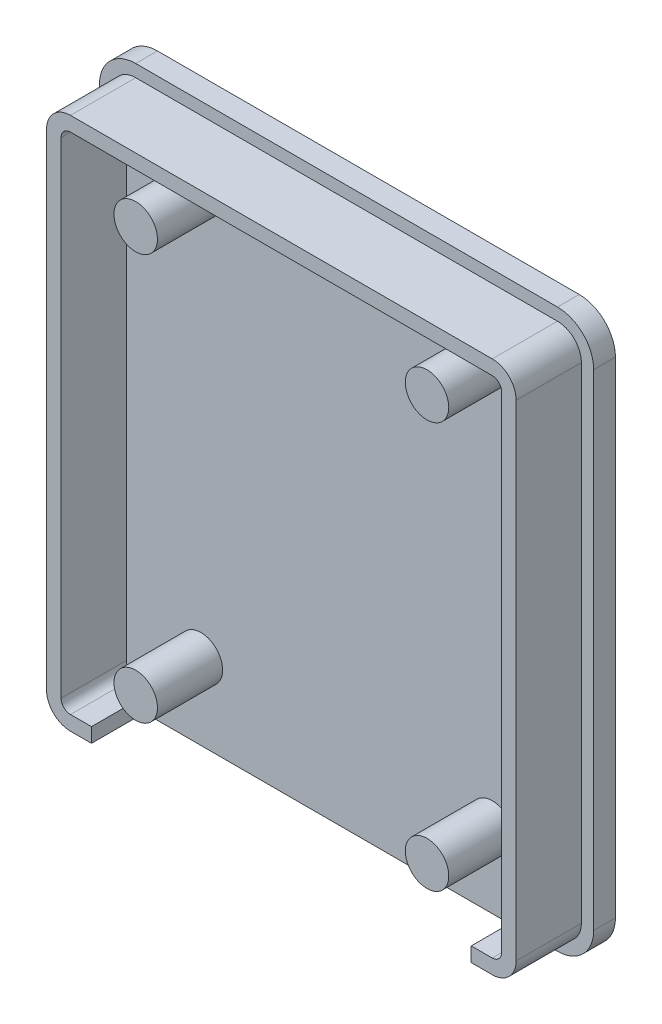
ISO-10303-21;
HEADER;
FILE_DESCRIPTION(('STEP AP214'),'2;1');
FILE_NAME('part.step','',(''),(''),'','','');
FILE_SCHEMA(('AUTOMOTIVE_DESIGN { 1 0 10303 214 1 1 1 1 }'));
ENDSEC;
DATA;
#1=APPLICATION_CONTEXT('core data for automotive mechanical design processes');
#2=APPLICATION_PROTOCOL_DEFINITION('international standard','automotive_design',2000,#1);
#3=PRODUCT_CONTEXT('',#1,'mechanical');
#4=PRODUCT('Part','Part','',(#3));
#5=PRODUCT_RELATED_PRODUCT_CATEGORY('part','',(#4));
#6=PRODUCT_DEFINITION_FORMATION('','',#4);
#7=PRODUCT_DEFINITION_CONTEXT('part definition',#1,'design');
#8=PRODUCT_DEFINITION('design','',#6,#7);
#9=PRODUCT_DEFINITION_SHAPE('','',#8);
#10=(LENGTH_UNIT() NAMED_UNIT(*) SI_UNIT(.MILLI.,.METRE.));
#11=(NAMED_UNIT(*) PLANE_ANGLE_UNIT() SI_UNIT($,.RADIAN.));
#12=(NAMED_UNIT(*) SI_UNIT($,.STERADIAN.) SOLID_ANGLE_UNIT());
#13=UNCERTAINTY_MEASURE_WITH_UNIT(LENGTH_MEASURE(1.E-05),#10,'distance_accuracy_value','');
#14=(GEOMETRIC_REPRESENTATION_CONTEXT(3) GLOBAL_UNCERTAINTY_ASSIGNED_CONTEXT((#13)) GLOBAL_UNIT_ASSIGNED_CONTEXT((#10,
#11,#12)) REPRESENTATION_CONTEXT('',''));
#15=CARTESIAN_POINT('',(0.,0.,0.));
#16=DIRECTION('',(0.,0.,1.));
#17=DIRECTION('',(1.,0.,0.));
#18=AXIS2_PLACEMENT_3D('',#15,#16,#17);
#19=CARTESIAN_POINT('',(-14.55,16.75,1.5));
#20=DIRECTION('',(0.,0.,-1.));
#21=DIRECTION('',(-1.,0.,0.));
#22=AXIS2_PLACEMENT_3D('',#19,#20,#21);
#23=CYLINDRICAL_SURFACE('',#22,2.5);
#24=CARTESIAN_POINT('',(-14.55,16.75,0.));
#25=DIRECTION('',(0.,0.,1.));
#26=DIRECTION('',(1.,0.,0.));
#27=AXIS2_PLACEMENT_3D('',#24,#25,#26);
#28=CIRCLE('',#27,2.5);
#29=CARTESIAN_POINT('',(-17.05,16.75,0.));
#30=VERTEX_POINT('',#29);
#31=CARTESIAN_POINT('',(-14.55,19.25,0.));
#32=VERTEX_POINT('',#31);
#33=EDGE_CURVE('E641',#30,#32,#28,.F.);
#34=ORIENTED_EDGE('',*,*,#33,.F.);
#35=DIRECTION('',(0.,0.,-1.));
#36=VECTOR('',#35,1.);
#37=CARTESIAN_POINT('',(-17.05,16.75,1.5));
#38=LINE('',#37,#36);
#39=CARTESIAN_POINT('',(-17.05,16.75,1.5));
#40=VERTEX_POINT('',#39);
#41=EDGE_CURVE('E293',#40,#30,#38,.T.);
#42=ORIENTED_EDGE('',*,*,#41,.F.);
#43=CARTESIAN_POINT('',(-14.55,16.75,1.5));
#44=DIRECTION('',(0.,0.,1.));
#45=DIRECTION('',(1.,0.,0.));
#46=AXIS2_PLACEMENT_3D('',#43,#44,#45);
#47=CIRCLE('',#46,2.5);
#48=CARTESIAN_POINT('',(-14.55,19.25,1.5));
#49=VERTEX_POINT('',#48);
#50=EDGE_CURVE('E642',#40,#49,#47,.F.);
#51=ORIENTED_EDGE('',*,*,#50,.T.);
#52=DIRECTION('',(0.,0.,-1.));
#53=VECTOR('',#52,1.);
#54=CARTESIAN_POINT('',(-14.55,19.25,1.5));
#55=LINE('',#54,#53);
#56=EDGE_CURVE('E664',#49,#32,#55,.T.);
#57=ORIENTED_EDGE('',*,*,#56,.T.);
#58=EDGE_LOOP('',(#34,#42,#51,#57));
#59=FACE_BOUND('',#58,.T.);
#60=ADVANCED_FACE('F290',(#59),#23,.T.);
#61=CARTESIAN_POINT('',(-17.05,0.,1.5));
#62=DIRECTION('',(-1.,0.,0.));
#63=DIRECTION('',(0.,0.,1.));
#64=AXIS2_PLACEMENT_3D('',#61,#62,#63);
#65=PLANE('',#64);
#66=DIRECTION('',(0.,1.,0.));
#67=VECTOR('',#66,1.);
#68=CARTESIAN_POINT('',(-17.05,0.,0.));
#69=LINE('',#68,#67);
#70=CARTESIAN_POINT('',(-17.05,-16.75,0.));
#71=VERTEX_POINT('',#70);
#72=EDGE_CURVE('E667',#71,#30,#69,.T.);
#73=ORIENTED_EDGE('',*,*,#72,.F.);
#74=DIRECTION('',(0.,0.,-1.));
#75=VECTOR('',#74,1.);
#76=CARTESIAN_POINT('',(-17.05,-16.75,1.5));
#77=LINE('',#76,#75);
#78=CARTESIAN_POINT('',(-17.05,-16.75,1.5));
#79=VERTEX_POINT('',#78);
#80=EDGE_CURVE('E697',#79,#71,#77,.T.);
#81=ORIENTED_EDGE('',*,*,#80,.F.);
#82=DIRECTION('',(0.,1.,0.));
#83=VECTOR('',#82,1.);
#84=CARTESIAN_POINT('',(-17.05,0.,1.5));
#85=LINE('',#84,#83);
#86=EDGE_CURVE('E645',#79,#40,#85,.T.);
#87=ORIENTED_EDGE('',*,*,#86,.T.);
#88=ORIENTED_EDGE('',*,*,#41,.T.);
#89=EDGE_LOOP('',(#73,#81,#87,#88));
#90=FACE_BOUND('',#89,.T.);
#91=ADVANCED_FACE('F741',(#90),#65,.T.);
#92=CARTESIAN_POINT('',(-14.55,-16.75,1.5));
#93=DIRECTION('',(0.,0.,-1.));
#94=DIRECTION('',(-1.,0.,0.));
#95=AXIS2_PLACEMENT_3D('',#92,#93,#94);
#96=CYLINDRICAL_SURFACE('',#95,2.5);
#97=CARTESIAN_POINT('',(-14.55,-16.75,0.));
#98=DIRECTION('',(0.,0.,1.));
#99=DIRECTION('',(1.,0.,0.));
#100=AXIS2_PLACEMENT_3D('',#97,#98,#99);
#101=CIRCLE('',#100,2.5);
#102=CARTESIAN_POINT('',(-14.55,-19.25,0.));
#103=VERTEX_POINT('',#102);
#104=EDGE_CURVE('E670',#103,#71,#101,.F.);
#105=ORIENTED_EDGE('',*,*,#104,.F.);
#106=DIRECTION('',(0.,0.,-1.));
#107=VECTOR('',#106,1.);
#108=CARTESIAN_POINT('',(-14.55,-19.25,1.5));
#109=LINE('',#108,#107);
#110=CARTESIAN_POINT('',(-14.55,-19.25,1.5));
#111=VERTEX_POINT('',#110);
#112=EDGE_CURVE('E696',#111,#103,#109,.T.);
#113=ORIENTED_EDGE('',*,*,#112,.F.);
#114=CARTESIAN_POINT('',(-14.55,-16.75,1.5));
#115=DIRECTION('',(0.,0.,1.));
#116=DIRECTION('',(1.,0.,0.));
#117=AXIS2_PLACEMENT_3D('',#114,#115,#116);
#118=CIRCLE('',#117,2.5);
#119=EDGE_CURVE('E649',#111,#79,#118,.F.);
#120=ORIENTED_EDGE('',*,*,#119,.T.);
#121=ORIENTED_EDGE('',*,*,#80,.T.);
#122=EDGE_LOOP('',(#105,#113,#120,#121));
#123=FACE_BOUND('',#122,.T.);
#124=ADVANCED_FACE('F746',(#123),#96,.T.);
#125=CARTESIAN_POINT('',(0.,-19.25,1.5));
#126=DIRECTION('',(0.,1.,0.));
#127=DIRECTION('',(0.,0.,1.));
#128=AXIS2_PLACEMENT_3D('',#125,#126,#127);
#129=PLANE('',#128);
#130=DIRECTION('',(1.,0.,0.));
#131=VECTOR('',#130,1.);
#132=CARTESIAN_POINT('',(0.,-19.25,0.));
#133=LINE('',#132,#131);
#134=CARTESIAN_POINT('',(14.55,-19.25,0.));
#135=VERTEX_POINT('',#134);
#136=EDGE_CURVE('E673',#103,#135,#133,.T.);
#137=ORIENTED_EDGE('',*,*,#136,.T.);
#138=DIRECTION('',(0.,0.,-1.));
#139=VECTOR('',#138,1.);
#140=CARTESIAN_POINT('',(14.55,-19.25,1.5));
#141=LINE('',#140,#139);
#142=CARTESIAN_POINT('',(14.55,-19.25,1.5));
#143=VERTEX_POINT('',#142);
#144=EDGE_CURVE('E693',#143,#135,#141,.T.);
#145=ORIENTED_EDGE('',*,*,#144,.F.);
#146=DIRECTION('',(1.,0.,0.));
#147=VECTOR('',#146,1.);
#148=CARTESIAN_POINT('',(0.,-19.25,1.5));
#149=LINE('',#148,#147);
#150=EDGE_CURVE('E652',#111,#143,#149,.T.);
#151=ORIENTED_EDGE('',*,*,#150,.F.);
#152=ORIENTED_EDGE('',*,*,#112,.T.);
#153=EDGE_LOOP('',(#137,#145,#151,#152));
#154=FACE_BOUND('',#153,.T.);
#155=ADVANCED_FACE('F760',(#154),#129,.F.);
#156=CARTESIAN_POINT('',(14.55,-16.75,1.5));
#157=DIRECTION('',(0.,0.,-1.));
#158=DIRECTION('',(-1.,0.,0.));
#159=AXIS2_PLACEMENT_3D('',#156,#157,#158);
#160=CYLINDRICAL_SURFACE('',#159,2.5);
#161=CARTESIAN_POINT('',(14.55,-16.75,0.));
#162=DIRECTION('',(0.,0.,1.));
#163=DIRECTION('',(1.,0.,0.));
#164=AXIS2_PLACEMENT_3D('',#161,#162,#163);
#165=CIRCLE('',#164,2.5);
#166=CARTESIAN_POINT('',(17.05,-16.75,0.));
#167=VERTEX_POINT('',#166);
#168=EDGE_CURVE('E675',#135,#167,#165,.T.);
#169=ORIENTED_EDGE('',*,*,#168,.T.);
#170=DIRECTION('',(0.,0.,-1.));
#171=VECTOR('',#170,1.);
#172=CARTESIAN_POINT('',(17.05,-16.75,1.5));
#173=LINE('',#172,#171);
#174=CARTESIAN_POINT('',(17.05,-16.75,1.5));
#175=VERTEX_POINT('',#174);
#176=EDGE_CURVE('E690',#175,#167,#173,.T.);
#177=ORIENTED_EDGE('',*,*,#176,.F.);
#178=CARTESIAN_POINT('',(14.55,-16.75,1.5));
#179=DIRECTION('',(0.,0.,1.));
#180=DIRECTION('',(1.,0.,0.));
#181=AXIS2_PLACEMENT_3D('',#178,#179,#180);
#182=CIRCLE('',#181,2.5);
#183=EDGE_CURVE('E654',#143,#175,#182,.T.);
#184=ORIENTED_EDGE('',*,*,#183,.F.);
#185=ORIENTED_EDGE('',*,*,#144,.T.);
#186=EDGE_LOOP('',(#169,#177,#184,#185));
#187=FACE_BOUND('',#186,.T.);
#188=ADVANCED_FACE('F767',(#187),#160,.T.);
#189=CARTESIAN_POINT('',(17.05,0.,1.5));
#190=DIRECTION('',(-1.,0.,0.));
#191=DIRECTION('',(0.,0.,1.));
#192=AXIS2_PLACEMENT_3D('',#189,#190,#191);
#193=PLANE('',#192);
#194=DIRECTION('',(0.,1.,0.));
#195=VECTOR('',#194,1.);
#196=CARTESIAN_POINT('',(17.05,0.,0.));
#197=LINE('',#196,#195);
#198=CARTESIAN_POINT('',(17.05,16.75,0.));
#199=VERTEX_POINT('',#198);
#200=EDGE_CURVE('E677',#167,#199,#197,.T.);
#201=ORIENTED_EDGE('',*,*,#200,.T.);
#202=DIRECTION('',(0.,0.,-1.));
#203=VECTOR('',#202,1.);
#204=CARTESIAN_POINT('',(17.05,16.75,1.5));
#205=LINE('',#204,#203);
#206=CARTESIAN_POINT('',(17.05,16.75,1.5));
#207=VERTEX_POINT('',#206);
#208=EDGE_CURVE('E688',#207,#199,#205,.T.);
#209=ORIENTED_EDGE('',*,*,#208,.F.);
#210=DIRECTION('',(0.,1.,0.));
#211=VECTOR('',#210,1.);
#212=CARTESIAN_POINT('',(17.05,0.,1.5));
#213=LINE('',#212,#211);
#214=EDGE_CURVE('E656',#175,#207,#213,.T.);
#215=ORIENTED_EDGE('',*,*,#214,.F.);
#216=ORIENTED_EDGE('',*,*,#176,.T.);
#217=EDGE_LOOP('',(#201,#209,#215,#216));
#218=FACE_BOUND('',#217,.T.);
#219=ADVANCED_FACE('F771',(#218),#193,.F.);
#220=CARTESIAN_POINT('',(14.55,16.75,1.5));
#221=DIRECTION('',(0.,0.,-1.));
#222=DIRECTION('',(-1.,0.,0.));
#223=AXIS2_PLACEMENT_3D('',#220,#221,#222);
#224=CYLINDRICAL_SURFACE('',#223,2.5);
#225=CARTESIAN_POINT('',(14.55,16.75,0.));
#226=DIRECTION('',(0.,0.,1.));
#227=DIRECTION('',(1.,0.,0.));
#228=AXIS2_PLACEMENT_3D('',#225,#226,#227);
#229=CIRCLE('',#228,2.5);
#230=CARTESIAN_POINT('',(14.55,19.25,0.));
#231=VERTEX_POINT('',#230);
#232=EDGE_CURVE('E680',#231,#199,#229,.F.);
#233=ORIENTED_EDGE('',*,*,#232,.F.);
#234=DIRECTION('',(0.,0.,-1.));
#235=VECTOR('',#234,1.);
#236=CARTESIAN_POINT('',(14.55,19.25,1.5));
#237=LINE('',#236,#235);
#238=CARTESIAN_POINT('',(14.55,19.25,1.5));
#239=VERTEX_POINT('',#238);
#240=EDGE_CURVE('E686',#239,#231,#237,.T.);
#241=ORIENTED_EDGE('',*,*,#240,.F.);
#242=CARTESIAN_POINT('',(14.55,16.75,1.5));
#243=DIRECTION('',(0.,0.,1.));
#244=DIRECTION('',(1.,0.,0.));
#245=AXIS2_PLACEMENT_3D('',#242,#243,#244);
#246=CIRCLE('',#245,2.5);
#247=EDGE_CURVE('E658',#239,#207,#246,.F.);
#248=ORIENTED_EDGE('',*,*,#247,.T.);
#249=ORIENTED_EDGE('',*,*,#208,.T.);
#250=EDGE_LOOP('',(#233,#241,#248,#249));
#251=FACE_BOUND('',#250,.T.);
#252=ADVANCED_FACE('F774',(#251),#224,.T.);
#253=CARTESIAN_POINT('',(0.,19.25,1.5));
#254=DIRECTION('',(0.,1.,0.));
#255=DIRECTION('',(0.,0.,1.));
#256=AXIS2_PLACEMENT_3D('',#253,#254,#255);
#257=PLANE('',#256);
#258=DIRECTION('',(1.,0.,0.));
#259=VECTOR('',#258,1.);
#260=CARTESIAN_POINT('',(0.,19.25,0.));
#261=LINE('',#260,#259);
#262=EDGE_CURVE('E646',#32,#231,#261,.T.);
#263=ORIENTED_EDGE('',*,*,#262,.F.);
#264=ORIENTED_EDGE('',*,*,#56,.F.);
#265=DIRECTION('',(1.,0.,0.));
#266=VECTOR('',#265,1.);
#267=CARTESIAN_POINT('',(0.,19.25,1.5));
#268=LINE('',#267,#266);
#269=EDGE_CURVE('E661',#49,#239,#268,.T.);
#270=ORIENTED_EDGE('',*,*,#269,.T.);
#271=ORIENTED_EDGE('',*,*,#240,.T.);
#272=EDGE_LOOP('',(#263,#264,#270,#271));
#273=FACE_BOUND('',#272,.T.);
#274=ADVANCED_FACE('F776',(#273),#257,.T.);
#275=CARTESIAN_POINT('',(0.,0.,1.5));
#276=DIRECTION('',(0.,0.,1.));
#277=DIRECTION('',(1.,0.,0.));
#278=AXIS2_PLACEMENT_3D('',#275,#276,#277);
#279=PLANE('',#278);
#280=CARTESIAN_POINT('',(10.05,14.,1.5));
#281=DIRECTION('',(0.,0.,1.));
#282=DIRECTION('',(1.,0.,0.));
#283=AXIS2_PLACEMENT_3D('',#280,#281,#282);
#284=CIRCLE('',#283,1.5);
#285=CARTESIAN_POINT('',(11.55,14.,1.5));
#286=VERTEX_POINT('',#285);
#287=EDGE_CURVE('E12',#286,#286,#284,.T.);
#288=ORIENTED_EDGE('',*,*,#287,.F.);
#289=EDGE_LOOP('',(#288));
#290=FACE_BOUND('',#289,.T.);
#291=CARTESIAN_POINT('',(10.05,-14.,1.5));
#292=DIRECTION('',(0.,0.,1.));
#293=DIRECTION('',(1.,0.,0.));
#294=AXIS2_PLACEMENT_3D('',#291,#292,#293);
#295=CIRCLE('',#294,1.5);
#296=CARTESIAN_POINT('',(11.55,-14.,1.5));
#297=VERTEX_POINT('',#296);
#298=EDGE_CURVE('E715',#297,#297,#295,.F.);
#299=ORIENTED_EDGE('',*,*,#298,.T.);
#300=EDGE_LOOP('',(#299));
#301=FACE_BOUND('',#300,.T.);
#302=CARTESIAN_POINT('',(-10.05,-14.,1.5));
#303=DIRECTION('',(0.,0.,1.));
#304=DIRECTION('',(1.,0.,0.));
#305=AXIS2_PLACEMENT_3D('',#302,#303,#304);
#306=CIRCLE('',#305,1.5);
#307=CARTESIAN_POINT('',(-8.55,-14.,1.5));
#308=VERTEX_POINT('',#307);
#309=EDGE_CURVE('E298',#308,#308,#306,.T.);
#310=ORIENTED_EDGE('',*,*,#309,.F.);
#311=EDGE_LOOP('',(#310));
#312=FACE_BOUND('',#311,.T.);
#313=CARTESIAN_POINT('',(-10.05,14.,1.5));
#314=DIRECTION('',(0.,0.,1.));
#315=DIRECTION('',(1.,0.,0.));
#316=AXIS2_PLACEMENT_3D('',#313,#314,#315);
#317=CIRCLE('',#316,1.5);
#318=CARTESIAN_POINT('',(-8.55,14.,1.5));
#319=VERTEX_POINT('',#318);
#320=EDGE_CURVE('E497',#319,#319,#317,.F.);
#321=ORIENTED_EDGE('',*,*,#320,.T.);
#322=EDGE_LOOP('',(#321));
#323=FACE_BOUND('',#322,.T.);
#324=DIRECTION('',(-1.,0.,0.));
#325=VECTOR('',#324,1.);
#326=CARTESIAN_POINT('',(0.,-17.4,1.5));
#327=LINE('',#326,#325);
#328=CARTESIAN_POINT('',(-13.1007663501877,-17.4,1.5));
#329=VERTEX_POINT('',#328);
#330=CARTESIAN_POINT('',(-14.55,-17.4,1.5));
#331=VERTEX_POINT('',#330);
#332=EDGE_CURVE('E481',#329,#331,#327,.T.);
#333=ORIENTED_EDGE('',*,*,#332,.F.);
#334=DIRECTION('',(0.,1.,0.));
#335=VECTOR('',#334,1.);
#336=CARTESIAN_POINT('',(-13.1007663501877,0.,1.5));
#337=LINE('',#336,#335);
#338=CARTESIAN_POINT('',(-13.1007663501877,-18.4,1.5));
#339=VERTEX_POINT('',#338);
#340=EDGE_CURVE('E483',#339,#329,#337,.T.);
#341=ORIENTED_EDGE('',*,*,#340,.F.);
#342=DIRECTION('',(-1.,0.,0.));
#343=VECTOR('',#342,1.);
#344=CARTESIAN_POINT('',(0.,-18.4,1.5));
#345=LINE('',#344,#343);
#346=CARTESIAN_POINT('',(-14.55,-18.4,1.5));
#347=VERTEX_POINT('',#346);
#348=EDGE_CURVE('E598',#339,#347,#345,.T.);
#349=ORIENTED_EDGE('',*,*,#348,.T.);
#350=CARTESIAN_POINT('',(-14.55,-16.75,1.5));
#351=DIRECTION('',(0.,0.,1.));
#352=DIRECTION('',(1.,0.,0.));
#353=AXIS2_PLACEMENT_3D('',#350,#351,#352);
#354=CIRCLE('',#353,1.65);
#355=CARTESIAN_POINT('',(-16.2,-16.75,1.5));
#356=VERTEX_POINT('',#355);
#357=EDGE_CURVE('E600',#356,#347,#354,.T.);
#358=ORIENTED_EDGE('',*,*,#357,.F.);
#359=DIRECTION('',(0.,-1.,0.));
#360=VECTOR('',#359,1.);
#361=CARTESIAN_POINT('',(-16.2,0.,1.5));
#362=LINE('',#361,#360);
#363=CARTESIAN_POINT('',(-16.2,16.75,1.5));
#364=VERTEX_POINT('',#363);
#365=EDGE_CURVE('E603',#364,#356,#362,.T.);
#366=ORIENTED_EDGE('',*,*,#365,.F.);
#367=CARTESIAN_POINT('',(-14.55,16.75,1.5));
#368=DIRECTION('',(0.,0.,1.));
#369=DIRECTION('',(1.,0.,0.));
#370=AXIS2_PLACEMENT_3D('',#367,#368,#369);
#371=CIRCLE('',#370,1.65);
#372=CARTESIAN_POINT('',(-14.55,18.4,1.5));
#373=VERTEX_POINT('',#372);
#374=EDGE_CURVE('E606',#373,#364,#371,.T.);
#375=ORIENTED_EDGE('',*,*,#374,.F.);
#376=DIRECTION('',(-1.,0.,0.));
#377=VECTOR('',#376,1.);
#378=CARTESIAN_POINT('',(0.,18.4,1.5));
#379=LINE('',#378,#377);
#380=CARTESIAN_POINT('',(14.55,18.4,1.5));
#381=VERTEX_POINT('',#380);
#382=EDGE_CURVE('E609',#381,#373,#379,.T.);
#383=ORIENTED_EDGE('',*,*,#382,.F.);
#384=CARTESIAN_POINT('',(14.55,16.75,1.5));
#385=DIRECTION('',(0.,0.,1.));
#386=DIRECTION('',(1.,0.,0.));
#387=AXIS2_PLACEMENT_3D('',#384,#385,#386);
#388=CIRCLE('',#387,1.65);
#389=CARTESIAN_POINT('',(16.2,16.75,1.5));
#390=VERTEX_POINT('',#389);
#391=EDGE_CURVE('E612',#390,#381,#388,.T.);
#392=ORIENTED_EDGE('',*,*,#391,.F.);
#393=DIRECTION('',(0.,-1.,0.));
#394=VECTOR('',#393,1.);
#395=CARTESIAN_POINT('',(16.2,0.,1.5));
#396=LINE('',#395,#394);
#397=CARTESIAN_POINT('',(16.2,-16.75,1.5));
#398=VERTEX_POINT('',#397);
#399=EDGE_CURVE('E615',#390,#398,#396,.T.);
#400=ORIENTED_EDGE('',*,*,#399,.T.);
#401=CARTESIAN_POINT('',(14.55,-16.75,1.5));
#402=DIRECTION('',(0.,0.,1.));
#403=DIRECTION('',(1.,0.,0.));
#404=AXIS2_PLACEMENT_3D('',#401,#402,#403);
#405=CIRCLE('',#404,1.65);
#406=CARTESIAN_POINT('',(14.55,-18.4,1.5));
#407=VERTEX_POINT('',#406);
#408=EDGE_CURVE('E617',#398,#407,#405,.F.);
#409=ORIENTED_EDGE('',*,*,#408,.T.);
#410=DIRECTION('',(-1.,0.,0.));
#411=VECTOR('',#410,1.);
#412=CARTESIAN_POINT('',(0.,-18.4,1.5));
#413=LINE('',#412,#411);
#414=CARTESIAN_POINT('',(13.1007663501877,-18.4,1.5));
#415=VERTEX_POINT('',#414);
#416=EDGE_CURVE('E619',#407,#415,#413,.T.);
#417=ORIENTED_EDGE('',*,*,#416,.T.);
#418=DIRECTION('',(0.,1.,0.));
#419=VECTOR('',#418,1.);
#420=CARTESIAN_POINT('',(13.1007663501877,0.,1.5));
#421=LINE('',#420,#419);
#422=CARTESIAN_POINT('',(13.1007663501877,-17.4,1.5));
#423=VERTEX_POINT('',#422);
#424=EDGE_CURVE('E621',#415,#423,#421,.T.);
#425=ORIENTED_EDGE('',*,*,#424,.T.);
#426=DIRECTION('',(-1.,0.,0.));
#427=VECTOR('',#426,1.);
#428=CARTESIAN_POINT('',(0.,-17.4,1.5));
#429=LINE('',#428,#427);
#430=CARTESIAN_POINT('',(14.55,-17.4,1.5));
#431=VERTEX_POINT('',#430);
#432=EDGE_CURVE('E623',#431,#423,#429,.T.);
#433=ORIENTED_EDGE('',*,*,#432,.F.);
#434=CARTESIAN_POINT('',(14.55,-16.75,1.5));
#435=DIRECTION('',(0.,0.,1.));
#436=DIRECTION('',(1.,0.,0.));
#437=AXIS2_PLACEMENT_3D('',#434,#435,#436);
#438=CIRCLE('',#437,0.65);
#439=CARTESIAN_POINT('',(15.2,-16.75,1.5));
#440=VERTEX_POINT('',#439);
#441=EDGE_CURVE('E626',#440,#431,#438,.F.);
#442=ORIENTED_EDGE('',*,*,#441,.F.);
#443=DIRECTION('',(0.,-1.,0.));
#444=VECTOR('',#443,1.);
#445=CARTESIAN_POINT('',(15.2,0.,1.5));
#446=LINE('',#445,#444);
#447=CARTESIAN_POINT('',(15.2,16.75,1.5));
#448=VERTEX_POINT('',#447);
#449=EDGE_CURVE('E629',#448,#440,#446,.T.);
#450=ORIENTED_EDGE('',*,*,#449,.F.);
#451=CARTESIAN_POINT('',(14.55,16.75,1.5));
#452=DIRECTION('',(0.,0.,1.));
#453=DIRECTION('',(1.,0.,0.));
#454=AXIS2_PLACEMENT_3D('',#451,#452,#453);
#455=CIRCLE('',#454,0.649999999999999);
#456=CARTESIAN_POINT('',(14.55,17.4,1.5));
#457=VERTEX_POINT('',#456);
#458=EDGE_CURVE('E632',#448,#457,#455,.T.);
#459=ORIENTED_EDGE('',*,*,#458,.T.);
#460=DIRECTION('',(-1.,0.,0.));
#461=VECTOR('',#460,1.);
#462=CARTESIAN_POINT('',(0.,17.4,1.5));
#463=LINE('',#462,#461);
#464=CARTESIAN_POINT('',(-14.55,17.4,1.5));
#465=VERTEX_POINT('',#464);
#466=EDGE_CURVE('E634',#457,#465,#463,.T.);
#467=ORIENTED_EDGE('',*,*,#466,.T.);
#468=CARTESIAN_POINT('',(-14.55,16.75,1.5));
#469=DIRECTION('',(0.,0.,1.));
#470=DIRECTION('',(1.,0.,0.));
#471=AXIS2_PLACEMENT_3D('',#468,#469,#470);
#472=CIRCLE('',#471,0.65);
#473=CARTESIAN_POINT('',(-15.2,16.75,1.5));
#474=VERTEX_POINT('',#473);
#475=EDGE_CURVE('E636',#465,#474,#472,.T.);
#476=ORIENTED_EDGE('',*,*,#475,.T.);
#477=DIRECTION('',(0.,-1.,0.));
#478=VECTOR('',#477,1.);
#479=CARTESIAN_POINT('',(-15.2,0.,1.5));
#480=LINE('',#479,#478);
#481=CARTESIAN_POINT('',(-15.2,-16.75,1.5));
#482=VERTEX_POINT('',#481);
#483=EDGE_CURVE('E311',#474,#482,#480,.T.);
#484=ORIENTED_EDGE('',*,*,#483,.T.);
#485=CARTESIAN_POINT('',(-14.55,-16.75,1.5));
#486=DIRECTION('',(0.,0.,1.));
#487=DIRECTION('',(1.,0.,0.));
#488=AXIS2_PLACEMENT_3D('',#485,#486,#487);
#489=CIRCLE('',#488,0.649999999999999);
#490=EDGE_CURVE('E306',#482,#331,#489,.T.);
#491=ORIENTED_EDGE('',*,*,#490,.T.);
#492=EDGE_LOOP('',(#333,#341,#349,#358,#366,#375,#383,#392,#400,#409,#417,#425,#433,#442,#450,
#459,#467,#476,#484,#491));
#493=FACE_BOUND('',#492,.T.);
#494=ORIENTED_EDGE('',*,*,#50,.F.);
#495=ORIENTED_EDGE('',*,*,#86,.F.);
#496=ORIENTED_EDGE('',*,*,#119,.F.);
#497=ORIENTED_EDGE('',*,*,#150,.T.);
#498=ORIENTED_EDGE('',*,*,#183,.T.);
#499=ORIENTED_EDGE('',*,*,#214,.T.);
#500=ORIENTED_EDGE('',*,*,#247,.F.);
#501=ORIENTED_EDGE('',*,*,#269,.F.);
#502=EDGE_LOOP('',(#494,#495,#496,#497,#498,#499,#500,#501));
#503=FACE_BOUND('',#502,.T.);
#504=ADVANCED_FACE('F755',(#290,#301,#312,#323,#493,#503),#279,.T.);
#505=CARTESIAN_POINT('',(0.,0.,0.));
#506=DIRECTION('',(0.,0.,1.));
#507=DIRECTION('',(1.,0.,0.));
#508=AXIS2_PLACEMENT_3D('',#505,#506,#507);
#509=PLANE('',#508);
#510=ORIENTED_EDGE('',*,*,#33,.T.);
#511=ORIENTED_EDGE('',*,*,#262,.T.);
#512=ORIENTED_EDGE('',*,*,#232,.T.);
#513=ORIENTED_EDGE('',*,*,#200,.F.);
#514=ORIENTED_EDGE('',*,*,#168,.F.);
#515=ORIENTED_EDGE('',*,*,#136,.F.);
#516=ORIENTED_EDGE('',*,*,#104,.T.);
#517=ORIENTED_EDGE('',*,*,#72,.T.);
#518=EDGE_LOOP('',(#510,#511,#512,#513,#514,#515,#516,#517));
#519=FACE_BOUND('',#518,.T.);
#520=ADVANCED_FACE('F750',(#519),#509,.F.);
#521=CARTESIAN_POINT('',(0.,-17.4,6.));
#522=DIRECTION('',(0.,1.,0.));
#523=DIRECTION('',(-1.,0.,0.));
#524=AXIS2_PLACEMENT_3D('',#521,#522,#523);
#525=PLANE('',#524);
#526=DIRECTION('',(0.,0.,-1.));
#527=VECTOR('',#526,1.);
#528=CARTESIAN_POINT('',(-13.1007663501877,-17.4,6.));
#529=LINE('',#528,#527);
#530=CARTESIAN_POINT('',(-13.1007663501877,-17.4,6.));
#531=VERTEX_POINT('',#530);
#532=EDGE_CURVE('E544',#531,#329,#529,.T.);
#533=ORIENTED_EDGE('',*,*,#532,.T.);
#534=ORIENTED_EDGE('',*,*,#332,.T.);
#535=DIRECTION('',(0.,0.,-1.));
#536=VECTOR('',#535,1.);
#537=CARTESIAN_POINT('',(-14.55,-17.4,6.));
#538=LINE('',#537,#536);
#539=CARTESIAN_POINT('',(-14.55,-17.4,6.));
#540=VERTEX_POINT('',#539);
#541=EDGE_CURVE('E474',#540,#331,#538,.T.);
#542=ORIENTED_EDGE('',*,*,#541,.F.);
#543=DIRECTION('',(1.,0.,0.));
#544=VECTOR('',#543,1.);
#545=CARTESIAN_POINT('',(0.,-17.4,6.));
#546=LINE('',#545,#544);
#547=EDGE_CURVE('E479',#540,#531,#546,.T.);
#548=ORIENTED_EDGE('',*,*,#547,.T.);
#549=EDGE_LOOP('',(#533,#534,#542,#548));
#550=FACE_BOUND('',#549,.T.);
#551=ADVANCED_FACE('F477',(#550),#525,.T.);
#552=CARTESIAN_POINT('',(-14.55,-16.75,6.));
#553=DIRECTION('',(0.,0.,-1.));
#554=DIRECTION('',(-1.,0.,0.));
#555=AXIS2_PLACEMENT_3D('',#552,#553,#554);
#556=CYLINDRICAL_SURFACE('',#555,0.649999999999999);
#557=ORIENTED_EDGE('',*,*,#490,.F.);
#558=DIRECTION('',(0.,0.,-1.));
#559=VECTOR('',#558,1.);
#560=CARTESIAN_POINT('',(-15.2,-16.75,6.));
#561=LINE('',#560,#559);
#562=CARTESIAN_POINT('',(-15.2,-16.75,6.));
#563=VERTEX_POINT('',#562);
#564=EDGE_CURVE('E484',#563,#482,#561,.T.);
#565=ORIENTED_EDGE('',*,*,#564,.F.);
#566=CARTESIAN_POINT('',(-14.55,-16.75,6.));
#567=DIRECTION('',(0.,0.,1.));
#568=DIRECTION('',(1.,0.,0.));
#569=AXIS2_PLACEMENT_3D('',#566,#567,#568);
#570=CIRCLE('',#569,0.649999999999999);
#571=EDGE_CURVE('E487',#540,#563,#570,.F.);
#572=ORIENTED_EDGE('',*,*,#571,.F.);
#573=ORIENTED_EDGE('',*,*,#541,.T.);
#574=EDGE_LOOP('',(#557,#565,#572,#573));
#575=FACE_BOUND('',#574,.T.);
#576=ADVANCED_FACE('F488',(#575),#556,.F.);
#577=CARTESIAN_POINT('',(-15.2,0.,6.));
#578=DIRECTION('',(-1.,0.,0.));
#579=DIRECTION('',(0.,0.,1.));
#580=AXIS2_PLACEMENT_3D('',#577,#578,#579);
#581=PLANE('',#580);
#582=ORIENTED_EDGE('',*,*,#483,.F.);
#583=DIRECTION('',(0.,0.,-1.));
#584=VECTOR('',#583,1.);
#585=CARTESIAN_POINT('',(-15.2,16.75,6.));
#586=LINE('',#585,#584);
#587=CARTESIAN_POINT('',(-15.2,16.75,6.));
#588=VERTEX_POINT('',#587);
#589=EDGE_CURVE('E592',#588,#474,#586,.T.);
#590=ORIENTED_EDGE('',*,*,#589,.F.);
#591=DIRECTION('',(0.,1.,0.));
#592=VECTOR('',#591,1.);
#593=CARTESIAN_POINT('',(-15.2,0.,6.));
#594=LINE('',#593,#592);
#595=EDGE_CURVE('E492',#563,#588,#594,.T.);
#596=ORIENTED_EDGE('',*,*,#595,.F.);
#597=ORIENTED_EDGE('',*,*,#564,.T.);
#598=EDGE_LOOP('',(#582,#590,#596,#597));
#599=FACE_BOUND('',#598,.T.);
#600=ADVANCED_FACE('F850',(#599),#581,.F.);
#601=CARTESIAN_POINT('',(-14.55,16.75,6.));
#602=DIRECTION('',(0.,0.,-1.));
#603=DIRECTION('',(-1.,0.,0.));
#604=AXIS2_PLACEMENT_3D('',#601,#602,#603);
#605=CYLINDRICAL_SURFACE('',#604,0.65);
#606=ORIENTED_EDGE('',*,*,#475,.F.);
#607=DIRECTION('',(0.,0.,-1.));
#608=VECTOR('',#607,1.);
#609=CARTESIAN_POINT('',(-14.55,17.4,6.));
#610=LINE('',#609,#608);
#611=CARTESIAN_POINT('',(-14.55,17.4,6.));
#612=VERTEX_POINT('',#611);
#613=EDGE_CURVE('E589',#612,#465,#610,.T.);
#614=ORIENTED_EDGE('',*,*,#613,.F.);
#615=CARTESIAN_POINT('',(-14.55,16.75,6.));
#616=DIRECTION('',(0.,0.,1.));
#617=DIRECTION('',(1.,0.,0.));
#618=AXIS2_PLACEMENT_3D('',#615,#616,#617);
#619=CIRCLE('',#618,0.65);
#620=EDGE_CURVE('E1139',#588,#612,#619,.F.);
#621=ORIENTED_EDGE('',*,*,#620,.F.);
#622=ORIENTED_EDGE('',*,*,#589,.T.);
#623=EDGE_LOOP('',(#606,#614,#621,#622));
#624=FACE_BOUND('',#623,.T.);
#625=ADVANCED_FACE('F859',(#624),#605,.F.);
#626=CARTESIAN_POINT('',(0.,17.4,6.));
#627=DIRECTION('',(0.,1.,0.));
#628=DIRECTION('',(-1.,0.,0.));
#629=AXIS2_PLACEMENT_3D('',#626,#627,#628);
#630=PLANE('',#629);
#631=ORIENTED_EDGE('',*,*,#466,.F.);
#632=DIRECTION('',(0.,0.,-1.));
#633=VECTOR('',#632,1.);
#634=CARTESIAN_POINT('',(14.55,17.4,6.));
#635=LINE('',#634,#633);
#636=CARTESIAN_POINT('',(14.55,17.4,6.));
#637=VERTEX_POINT('',#636);
#638=EDGE_CURVE('E586',#637,#457,#635,.T.);
#639=ORIENTED_EDGE('',*,*,#638,.F.);
#640=DIRECTION('',(1.,0.,0.));
#641=VECTOR('',#640,1.);
#642=CARTESIAN_POINT('',(0.,17.4,6.));
#643=LINE('',#642,#641);
#644=EDGE_CURVE('E1132',#612,#637,#643,.T.);
#645=ORIENTED_EDGE('',*,*,#644,.F.);
#646=ORIENTED_EDGE('',*,*,#613,.T.);
#647=EDGE_LOOP('',(#631,#639,#645,#646));
#648=FACE_BOUND('',#647,.T.);
#649=ADVANCED_FACE('F869',(#648),#630,.F.);
#650=CARTESIAN_POINT('',(14.55,16.75,6.));
#651=DIRECTION('',(0.,0.,-1.));
#652=DIRECTION('',(-1.,0.,0.));
#653=AXIS2_PLACEMENT_3D('',#650,#651,#652);
#654=CYLINDRICAL_SURFACE('',#653,0.649999999999999);
#655=ORIENTED_EDGE('',*,*,#458,.F.);
#656=DIRECTION('',(0.,0.,-1.));
#657=VECTOR('',#656,1.);
#658=CARTESIAN_POINT('',(15.2,16.75,6.));
#659=LINE('',#658,#657);
#660=CARTESIAN_POINT('',(15.2,16.75,6.));
#661=VERTEX_POINT('',#660);
#662=EDGE_CURVE('E583',#661,#448,#659,.T.);
#663=ORIENTED_EDGE('',*,*,#662,.F.);
#664=CARTESIAN_POINT('',(14.55,16.75,6.));
#665=DIRECTION('',(0.,0.,1.));
#666=DIRECTION('',(1.,0.,0.));
#667=AXIS2_PLACEMENT_3D('',#664,#665,#666);
#668=CIRCLE('',#667,0.649999999999999);
#669=EDGE_CURVE('E518',#637,#661,#668,.F.);
#670=ORIENTED_EDGE('',*,*,#669,.F.);
#671=ORIENTED_EDGE('',*,*,#638,.T.);
#672=EDGE_LOOP('',(#655,#663,#670,#671));
#673=FACE_BOUND('',#672,.T.);
#674=ADVANCED_FACE('F879',(#673),#654,.F.);
#675=CARTESIAN_POINT('',(15.2,0.,6.));
#676=DIRECTION('',(-1.,0.,0.));
#677=DIRECTION('',(0.,0.,1.));
#678=AXIS2_PLACEMENT_3D('',#675,#676,#677);
#679=PLANE('',#678);
#680=ORIENTED_EDGE('',*,*,#662,.T.);
#681=ORIENTED_EDGE('',*,*,#449,.T.);
#682=DIRECTION('',(0.,0.,-1.));
#683=VECTOR('',#682,1.);
#684=CARTESIAN_POINT('',(15.2,-16.75,6.));
#685=LINE('',#684,#683);
#686=CARTESIAN_POINT('',(15.2,-16.75,6.));
#687=VERTEX_POINT('',#686);
#688=EDGE_CURVE('E581',#687,#440,#685,.T.);
#689=ORIENTED_EDGE('',*,*,#688,.F.);
#690=DIRECTION('',(0.,1.,0.));
#691=VECTOR('',#690,1.);
#692=CARTESIAN_POINT('',(15.2,0.,6.));
#693=LINE('',#692,#691);
#694=EDGE_CURVE('E512',#687,#661,#693,.T.);
#695=ORIENTED_EDGE('',*,*,#694,.T.);
#696=EDGE_LOOP('',(#680,#681,#689,#695));
#697=FACE_BOUND('',#696,.T.);
#698=ADVANCED_FACE('F889',(#697),#679,.T.);
#699=CARTESIAN_POINT('',(14.55,-16.75,6.));
#700=DIRECTION('',(0.,0.,-1.));
#701=DIRECTION('',(-1.,0.,0.));
#702=AXIS2_PLACEMENT_3D('',#699,#700,#701);
#703=CYLINDRICAL_SURFACE('',#702,0.65);
#704=ORIENTED_EDGE('',*,*,#688,.T.);
#705=ORIENTED_EDGE('',*,*,#441,.T.);
#706=DIRECTION('',(0.,0.,-1.));
#707=VECTOR('',#706,1.);
#708=CARTESIAN_POINT('',(14.55,-17.4,6.));
#709=LINE('',#708,#707);
#710=CARTESIAN_POINT('',(14.55,-17.4,6.));
#711=VERTEX_POINT('',#710);
#712=EDGE_CURVE('E579',#711,#431,#709,.T.);
#713=ORIENTED_EDGE('',*,*,#712,.F.);
#714=CARTESIAN_POINT('',(14.55,-16.75,6.));
#715=DIRECTION('',(0.,0.,1.));
#716=DIRECTION('',(1.,0.,0.));
#717=AXIS2_PLACEMENT_3D('',#714,#715,#716);
#718=CIRCLE('',#717,0.65);
#719=EDGE_CURVE('E505',#711,#687,#718,.T.);
#720=ORIENTED_EDGE('',*,*,#719,.T.);
#721=EDGE_LOOP('',(#704,#705,#713,#720));
#722=FACE_BOUND('',#721,.T.);
#723=ADVANCED_FACE('F899',(#722),#703,.F.);
#724=ORIENTED_EDGE('',*,*,#712,.T.);
#725=ORIENTED_EDGE('',*,*,#432,.T.);
#726=DIRECTION('',(0.,0.,-1.));
#727=VECTOR('',#726,1.);
#728=CARTESIAN_POINT('',(13.1007663501877,-17.4,6.));
#729=LINE('',#728,#727);
#730=CARTESIAN_POINT('',(13.1007663501877,-17.4,6.));
#731=VERTEX_POINT('',#730);
#732=EDGE_CURVE('E576',#731,#423,#729,.T.);
#733=ORIENTED_EDGE('',*,*,#732,.F.);
#734=EDGE_CURVE('E499',#731,#711,#546,.T.);
#735=ORIENTED_EDGE('',*,*,#734,.T.);
#736=EDGE_LOOP('',(#724,#725,#733,#735));
#737=FACE_BOUND('',#736,.T.);
#738=ADVANCED_FACE('F842',(#737),#525,.T.);
#739=CARTESIAN_POINT('',(13.1007663501877,0.,6.));
#740=DIRECTION('',(1.,0.,0.));
#741=DIRECTION('',(0.,0.,-1.));
#742=AXIS2_PLACEMENT_3D('',#739,#740,#741);
#743=PLANE('',#742);
#744=ORIENTED_EDGE('',*,*,#424,.F.);
#745=DIRECTION('',(0.,0.,-1.));
#746=VECTOR('',#745,1.);
#747=CARTESIAN_POINT('',(13.1007663501877,-18.4,6.));
#748=LINE('',#747,#746);
#749=CARTESIAN_POINT('',(13.1007663501877,-18.4,6.));
#750=VERTEX_POINT('',#749);
#751=EDGE_CURVE('E573',#750,#415,#748,.T.);
#752=ORIENTED_EDGE('',*,*,#751,.F.);
#753=DIRECTION('',(0.,-1.,0.));
#754=VECTOR('',#753,1.);
#755=CARTESIAN_POINT('',(13.1007663501877,0.,6.));
#756=LINE('',#755,#754);
#757=EDGE_CURVE('E504',#731,#750,#756,.T.);
#758=ORIENTED_EDGE('',*,*,#757,.F.);
#759=ORIENTED_EDGE('',*,*,#732,.T.);
#760=EDGE_LOOP('',(#744,#752,#758,#759));
#761=FACE_BOUND('',#760,.T.);
#762=ADVANCED_FACE('F917',(#761),#743,.F.);
#763=CARTESIAN_POINT('',(0.,-18.4,6.));
#764=DIRECTION('',(0.,1.,0.));
#765=DIRECTION('',(0.,0.,1.));
#766=AXIS2_PLACEMENT_3D('',#763,#764,#765);
#767=PLANE('',#766);
#768=ORIENTED_EDGE('',*,*,#416,.F.);
#769=DIRECTION('',(0.,0.,-1.));
#770=VECTOR('',#769,1.);
#771=CARTESIAN_POINT('',(14.55,-18.4,6.));
#772=LINE('',#771,#770);
#773=CARTESIAN_POINT('',(14.55,-18.4,6.));
#774=VERTEX_POINT('',#773);
#775=EDGE_CURVE('E570',#774,#407,#772,.T.);
#776=ORIENTED_EDGE('',*,*,#775,.F.);
#777=DIRECTION('',(1.,0.,0.));
#778=VECTOR('',#777,1.);
#779=CARTESIAN_POINT('',(0.,-18.4,6.));
#780=LINE('',#779,#778);
#781=EDGE_CURVE('E509',#750,#774,#780,.T.);
#782=ORIENTED_EDGE('',*,*,#781,.F.);
#783=ORIENTED_EDGE('',*,*,#751,.T.);
#784=EDGE_LOOP('',(#768,#776,#782,#783));
#785=FACE_BOUND('',#784,.T.);
#786=ADVANCED_FACE('F925',(#785),#767,.F.);
#787=CARTESIAN_POINT('',(14.55,-16.75,6.));
#788=DIRECTION('',(0.,0.,-1.));
#789=DIRECTION('',(-1.,0.,0.));
#790=AXIS2_PLACEMENT_3D('',#787,#788,#789);
#791=CYLINDRICAL_SURFACE('',#790,1.65);
#792=ORIENTED_EDGE('',*,*,#408,.F.);
#793=DIRECTION('',(0.,0.,-1.));
#794=VECTOR('',#793,1.);
#795=CARTESIAN_POINT('',(16.2,-16.75,6.));
#796=LINE('',#795,#794);
#797=CARTESIAN_POINT('',(16.2,-16.75,6.));
#798=VERTEX_POINT('',#797);
#799=EDGE_CURVE('E567',#798,#398,#796,.T.);
#800=ORIENTED_EDGE('',*,*,#799,.F.);
#801=CARTESIAN_POINT('',(14.55,-16.75,6.));
#802=DIRECTION('',(0.,0.,1.));
#803=DIRECTION('',(1.,0.,0.));
#804=AXIS2_PLACEMENT_3D('',#801,#802,#803);
#805=CIRCLE('',#804,1.65);
#806=EDGE_CURVE('E523',#774,#798,#805,.T.);
#807=ORIENTED_EDGE('',*,*,#806,.F.);
#808=ORIENTED_EDGE('',*,*,#775,.T.);
#809=EDGE_LOOP('',(#792,#800,#807,#808));
#810=FACE_BOUND('',#809,.T.);
#811=ADVANCED_FACE('F935',(#810),#791,.T.);
#812=CARTESIAN_POINT('',(16.2,0.,6.));
#813=DIRECTION('',(-1.,0.,0.));
#814=DIRECTION('',(0.,0.,1.));
#815=AXIS2_PLACEMENT_3D('',#812,#813,#814);
#816=PLANE('',#815);
#817=ORIENTED_EDGE('',*,*,#399,.F.);
#818=DIRECTION('',(0.,0.,-1.));
#819=VECTOR('',#818,1.);
#820=CARTESIAN_POINT('',(16.2,16.75,6.));
#821=LINE('',#820,#819);
#822=CARTESIAN_POINT('',(16.2,16.75,6.));
#823=VERTEX_POINT('',#822);
#824=EDGE_CURVE('E564',#823,#390,#821,.T.);
#825=ORIENTED_EDGE('',*,*,#824,.F.);
#826=DIRECTION('',(0.,1.,0.));
#827=VECTOR('',#826,1.);
#828=CARTESIAN_POINT('',(16.2,0.,6.));
#829=LINE('',#828,#827);
#830=EDGE_CURVE('E526',#798,#823,#829,.T.);
#831=ORIENTED_EDGE('',*,*,#830,.F.);
#832=ORIENTED_EDGE('',*,*,#799,.T.);
#833=EDGE_LOOP('',(#817,#825,#831,#832));
#834=FACE_BOUND('',#833,.T.);
#835=ADVANCED_FACE('F946',(#834),#816,.F.);
#836=CARTESIAN_POINT('',(14.55,16.75,6.));
#837=DIRECTION('',(0.,0.,-1.));
#838=DIRECTION('',(-1.,0.,0.));
#839=AXIS2_PLACEMENT_3D('',#836,#837,#838);
#840=CYLINDRICAL_SURFACE('',#839,1.65);
#841=ORIENTED_EDGE('',*,*,#824,.T.);
#842=ORIENTED_EDGE('',*,*,#391,.T.);
#843=DIRECTION('',(0.,0.,-1.));
#844=VECTOR('',#843,1.);
#845=CARTESIAN_POINT('',(14.55,18.4,6.));
#846=LINE('',#845,#844);
#847=CARTESIAN_POINT('',(14.55,18.4,6.));
#848=VERTEX_POINT('',#847);
#849=EDGE_CURVE('E561',#848,#381,#846,.T.);
#850=ORIENTED_EDGE('',*,*,#849,.F.);
#851=CARTESIAN_POINT('',(14.55,16.75,6.));
#852=DIRECTION('',(0.,0.,1.));
#853=DIRECTION('',(1.,0.,0.));
#854=AXIS2_PLACEMENT_3D('',#851,#852,#853);
#855=CIRCLE('',#854,1.65);
#856=EDGE_CURVE('E528',#848,#823,#855,.F.);
#857=ORIENTED_EDGE('',*,*,#856,.T.);
#858=EDGE_LOOP('',(#841,#842,#850,#857));
#859=FACE_BOUND('',#858,.T.);
#860=ADVANCED_FACE('F956',(#859),#840,.T.);
#861=CARTESIAN_POINT('',(0.,18.4,6.));
#862=DIRECTION('',(0.,1.,0.));
#863=DIRECTION('',(0.,0.,1.));
#864=AXIS2_PLACEMENT_3D('',#861,#862,#863);
#865=PLANE('',#864);
#866=ORIENTED_EDGE('',*,*,#849,.T.);
#867=ORIENTED_EDGE('',*,*,#382,.T.);
#868=DIRECTION('',(0.,0.,-1.));
#869=VECTOR('',#868,1.);
#870=CARTESIAN_POINT('',(-14.55,18.4,6.));
#871=LINE('',#870,#869);
#872=CARTESIAN_POINT('',(-14.55,18.4,6.));
#873=VERTEX_POINT('',#872);
#874=EDGE_CURVE('E558',#873,#373,#871,.T.);
#875=ORIENTED_EDGE('',*,*,#874,.F.);
#876=DIRECTION('',(1.,0.,0.));
#877=VECTOR('',#876,1.);
#878=CARTESIAN_POINT('',(0.,18.4,6.));
#879=LINE('',#878,#877);
#880=EDGE_CURVE('E531',#873,#848,#879,.T.);
#881=ORIENTED_EDGE('',*,*,#880,.T.);
#882=EDGE_LOOP('',(#866,#867,#875,#881));
#883=FACE_BOUND('',#882,.T.);
#884=ADVANCED_FACE('F966',(#883),#865,.T.);
#885=CARTESIAN_POINT('',(-14.55,16.75,6.));
#886=DIRECTION('',(0.,0.,-1.));
#887=DIRECTION('',(-1.,0.,0.));
#888=AXIS2_PLACEMENT_3D('',#885,#886,#887);
#889=CYLINDRICAL_SURFACE('',#888,1.65);
#890=ORIENTED_EDGE('',*,*,#874,.T.);
#891=ORIENTED_EDGE('',*,*,#374,.T.);
#892=DIRECTION('',(0.,0.,-1.));
#893=VECTOR('',#892,1.);
#894=CARTESIAN_POINT('',(-16.2,16.75,6.));
#895=LINE('',#894,#893);
#896=CARTESIAN_POINT('',(-16.2,16.75,6.));
#897=VERTEX_POINT('',#896);
#898=EDGE_CURVE('E555',#897,#364,#895,.T.);
#899=ORIENTED_EDGE('',*,*,#898,.F.);
#900=CARTESIAN_POINT('',(-14.55,16.75,6.));
#901=DIRECTION('',(0.,0.,1.));
#902=DIRECTION('',(1.,0.,0.));
#903=AXIS2_PLACEMENT_3D('',#900,#901,#902);
#904=CIRCLE('',#903,1.65);
#905=EDGE_CURVE('E534',#897,#873,#904,.F.);
#906=ORIENTED_EDGE('',*,*,#905,.T.);
#907=EDGE_LOOP('',(#890,#891,#899,#906));
#908=FACE_BOUND('',#907,.T.);
#909=ADVANCED_FACE('F976',(#908),#889,.T.);
#910=CARTESIAN_POINT('',(-16.2,0.,6.));
#911=DIRECTION('',(-1.,0.,0.));
#912=DIRECTION('',(0.,0.,1.));
#913=AXIS2_PLACEMENT_3D('',#910,#911,#912);
#914=PLANE('',#913);
#915=ORIENTED_EDGE('',*,*,#898,.T.);
#916=ORIENTED_EDGE('',*,*,#365,.T.);
#917=DIRECTION('',(0.,0.,-1.));
#918=VECTOR('',#917,1.);
#919=CARTESIAN_POINT('',(-16.2,-16.75,6.));
#920=LINE('',#919,#918);
#921=CARTESIAN_POINT('',(-16.2,-16.75,6.));
#922=VERTEX_POINT('',#921);
#923=EDGE_CURVE('E552',#922,#356,#920,.T.);
#924=ORIENTED_EDGE('',*,*,#923,.F.);
#925=DIRECTION('',(0.,1.,0.));
#926=VECTOR('',#925,1.);
#927=CARTESIAN_POINT('',(-16.2,0.,6.));
#928=LINE('',#927,#926);
#929=EDGE_CURVE('E537',#922,#897,#928,.T.);
#930=ORIENTED_EDGE('',*,*,#929,.T.);
#931=EDGE_LOOP('',(#915,#916,#924,#930));
#932=FACE_BOUND('',#931,.T.);
#933=ADVANCED_FACE('F986',(#932),#914,.T.);
#934=CARTESIAN_POINT('',(-14.55,-16.75,6.));
#935=DIRECTION('',(0.,0.,-1.));
#936=DIRECTION('',(-1.,0.,0.));
#937=AXIS2_PLACEMENT_3D('',#934,#935,#936);
#938=CYLINDRICAL_SURFACE('',#937,1.65);
#939=ORIENTED_EDGE('',*,*,#923,.T.);
#940=ORIENTED_EDGE('',*,*,#357,.T.);
#941=DIRECTION('',(0.,0.,-1.));
#942=VECTOR('',#941,1.);
#943=CARTESIAN_POINT('',(-14.55,-18.4,6.));
#944=LINE('',#943,#942);
#945=CARTESIAN_POINT('',(-14.55,-18.4,6.));
#946=VERTEX_POINT('',#945);
#947=EDGE_CURVE('E549',#946,#347,#944,.T.);
#948=ORIENTED_EDGE('',*,*,#947,.F.);
#949=CARTESIAN_POINT('',(-14.55,-16.75,6.));
#950=DIRECTION('',(0.,0.,1.));
#951=DIRECTION('',(1.,0.,0.));
#952=AXIS2_PLACEMENT_3D('',#949,#950,#951);
#953=CIRCLE('',#952,1.65);
#954=EDGE_CURVE('E540',#946,#922,#953,.F.);
#955=ORIENTED_EDGE('',*,*,#954,.T.);
#956=EDGE_LOOP('',(#939,#940,#948,#955));
#957=FACE_BOUND('',#956,.T.);
#958=ADVANCED_FACE('F996',(#957),#938,.T.);
#959=ORIENTED_EDGE('',*,*,#348,.F.);
#960=DIRECTION('',(0.,0.,-1.));
#961=VECTOR('',#960,1.);
#962=CARTESIAN_POINT('',(-13.1007663501877,-18.4,6.));
#963=LINE('',#962,#961);
#964=CARTESIAN_POINT('',(-13.1007663501877,-18.4,6.));
#965=VERTEX_POINT('',#964);
#966=EDGE_CURVE('E546',#965,#339,#963,.T.);
#967=ORIENTED_EDGE('',*,*,#966,.F.);
#968=EDGE_CURVE('E524',#946,#965,#780,.T.);
#969=ORIENTED_EDGE('',*,*,#968,.F.);
#970=ORIENTED_EDGE('',*,*,#947,.T.);
#971=EDGE_LOOP('',(#959,#967,#969,#970));
#972=FACE_BOUND('',#971,.T.);
#973=ADVANCED_FACE('F938',(#972),#767,.F.);
#974=CARTESIAN_POINT('',(-13.1007663501877,0.,6.));
#975=DIRECTION('',(1.,0.,0.));
#976=DIRECTION('',(0.,0.,-1.));
#977=AXIS2_PLACEMENT_3D('',#974,#975,#976);
#978=PLANE('',#977);
#979=ORIENTED_EDGE('',*,*,#966,.T.);
#980=ORIENTED_EDGE('',*,*,#340,.T.);
#981=ORIENTED_EDGE('',*,*,#532,.F.);
#982=DIRECTION('',(0.,-1.,0.));
#983=VECTOR('',#982,1.);
#984=CARTESIAN_POINT('',(-13.1007663501877,0.,6.));
#985=LINE('',#984,#983);
#986=EDGE_CURVE('E496',#531,#965,#985,.T.);
#987=ORIENTED_EDGE('',*,*,#986,.T.);
#988=EDGE_LOOP('',(#979,#980,#981,#987));
#989=FACE_BOUND('',#988,.T.);
#990=ADVANCED_FACE('F1015',(#989),#978,.T.);
#991=CARTESIAN_POINT('',(0.,0.,6.));
#992=DIRECTION('',(0.,0.,1.));
#993=DIRECTION('',(1.,0.,0.));
#994=AXIS2_PLACEMENT_3D('',#991,#992,#993);
#995=PLANE('',#994);
#996=ORIENTED_EDGE('',*,*,#547,.F.);
#997=ORIENTED_EDGE('',*,*,#571,.T.);
#998=ORIENTED_EDGE('',*,*,#595,.T.);
#999=ORIENTED_EDGE('',*,*,#620,.T.);
#1000=ORIENTED_EDGE('',*,*,#644,.T.);
#1001=ORIENTED_EDGE('',*,*,#669,.T.);
#1002=ORIENTED_EDGE('',*,*,#694,.F.);
#1003=ORIENTED_EDGE('',*,*,#719,.F.);
#1004=ORIENTED_EDGE('',*,*,#734,.F.);
#1005=ORIENTED_EDGE('',*,*,#757,.T.);
#1006=ORIENTED_EDGE('',*,*,#781,.T.);
#1007=ORIENTED_EDGE('',*,*,#806,.T.);
#1008=ORIENTED_EDGE('',*,*,#830,.T.);
#1009=ORIENTED_EDGE('',*,*,#856,.F.);
#1010=ORIENTED_EDGE('',*,*,#880,.F.);
#1011=ORIENTED_EDGE('',*,*,#905,.F.);
#1012=ORIENTED_EDGE('',*,*,#929,.F.);
#1013=ORIENTED_EDGE('',*,*,#954,.F.);
#1014=ORIENTED_EDGE('',*,*,#968,.T.);
#1015=ORIENTED_EDGE('',*,*,#986,.F.);
#1016=EDGE_LOOP('',(#996,#997,#998,#999,#1000,#1001,#1002,#1003,#1004,#1005,#1006,#1007,#1008,
#1009,#1010,#1011,#1012,#1013,#1014,#1015));
#1017=FACE_BOUND('',#1016,.T.);
#1018=ADVANCED_FACE('F494',(#1017),#995,.T.);
#1019=CARTESIAN_POINT('',(-10.05,14.,6.));
#1020=DIRECTION('',(0.,0.,-1.));
#1021=DIRECTION('',(-1.,0.,0.));
#1022=AXIS2_PLACEMENT_3D('',#1019,#1020,#1021);
#1023=CYLINDRICAL_SURFACE('',#1022,1.5);
#1024=ORIENTED_EDGE('',*,*,#320,.F.);
#1025=EDGE_LOOP('',(#1024));
#1026=FACE_BOUND('',#1025,.T.);
#1027=CARTESIAN_POINT('',(-10.05,14.,6.));
#1028=DIRECTION('',(0.,0.,1.));
#1029=DIRECTION('',(1.,0.,0.));
#1030=AXIS2_PLACEMENT_3D('',#1027,#1028,#1029);
#1031=CIRCLE('',#1030,1.5);
#1032=CARTESIAN_POINT('',(-8.55,14.,6.));
#1033=VERTEX_POINT('',#1032);
#1034=EDGE_CURVE('E501',#1033,#1033,#1031,.T.);
#1035=ORIENTED_EDGE('',*,*,#1034,.F.);
#1036=EDGE_LOOP('',(#1035));
#1037=FACE_BOUND('',#1036,.T.);
#1038=ADVANCED_FACE('F1033',(#1026,#1037),#1023,.T.);
#1039=CARTESIAN_POINT('',(0.,0.,6.));
#1040=DIRECTION('',(0.,0.,1.));
#1041=DIRECTION('',(1.,0.,0.));
#1042=AXIS2_PLACEMENT_3D('',#1039,#1040,#1041);
#1043=PLANE('',#1042);
#1044=ORIENTED_EDGE('',*,*,#1034,.T.);
#1045=EDGE_LOOP('',(#1044));
#1046=FACE_BOUND('',#1045,.T.);
#1047=ADVANCED_FACE('F1042',(#1046),#1043,.T.);
#1048=CARTESIAN_POINT('',(-10.05,-14.,6.));
#1049=DIRECTION('',(0.,0.,-1.));
#1050=DIRECTION('',(-1.,0.,0.));
#1051=AXIS2_PLACEMENT_3D('',#1048,#1049,#1050);
#1052=CYLINDRICAL_SURFACE('',#1051,1.5);
#1053=ORIENTED_EDGE('',*,*,#309,.T.);
#1054=EDGE_LOOP('',(#1053));
#1055=FACE_BOUND('',#1054,.T.);
#1056=CARTESIAN_POINT('',(-10.05,-14.,6.));
#1057=DIRECTION('',(0.,0.,1.));
#1058=DIRECTION('',(1.,0.,0.));
#1059=AXIS2_PLACEMENT_3D('',#1056,#1057,#1058);
#1060=CIRCLE('',#1059,1.5);
#1061=CARTESIAN_POINT('',(-8.55,-14.,6.));
#1062=VERTEX_POINT('',#1061);
#1063=EDGE_CURVE('E709',#1062,#1062,#1060,.F.);
#1064=ORIENTED_EDGE('',*,*,#1063,.T.);
#1065=EDGE_LOOP('',(#1064));
#1066=FACE_BOUND('',#1065,.T.);
#1067=ADVANCED_FACE('F1052',(#1055,#1066),#1052,.T.);
#1068=CARTESIAN_POINT('',(0.,0.,6.));
#1069=DIRECTION('',(0.,0.,1.));
#1070=DIRECTION('',(1.,0.,0.));
#1071=AXIS2_PLACEMENT_3D('',#1068,#1069,#1070);
#1072=PLANE('',#1071);
#1073=ORIENTED_EDGE('',*,*,#1063,.F.);
#1074=EDGE_LOOP('',(#1073));
#1075=FACE_BOUND('',#1074,.T.);
#1076=ADVANCED_FACE('F1061',(#1075),#1072,.T.);
#1077=CARTESIAN_POINT('',(10.05,-14.,6.));
#1078=DIRECTION('',(0.,0.,-1.));
#1079=DIRECTION('',(-1.,0.,0.));
#1080=AXIS2_PLACEMENT_3D('',#1077,#1078,#1079);
#1081=CYLINDRICAL_SURFACE('',#1080,1.5);
#1082=ORIENTED_EDGE('',*,*,#298,.F.);
#1083=EDGE_LOOP('',(#1082));
#1084=FACE_BOUND('',#1083,.T.);
#1085=CARTESIAN_POINT('',(10.05,-14.,6.));
#1086=DIRECTION('',(0.,0.,1.));
#1087=DIRECTION('',(1.,0.,0.));
#1088=AXIS2_PLACEMENT_3D('',#1085,#1086,#1087);
#1089=CIRCLE('',#1088,1.5);
#1090=CARTESIAN_POINT('',(11.55,-14.,6.));
#1091=VERTEX_POINT('',#1090);
#1092=EDGE_CURVE('E719',#1091,#1091,#1089,.T.);
#1093=ORIENTED_EDGE('',*,*,#1092,.F.);
#1094=EDGE_LOOP('',(#1093));
#1095=FACE_BOUND('',#1094,.T.);
#1096=ADVANCED_FACE('F1070',(#1084,#1095),#1081,.T.);
#1097=CARTESIAN_POINT('',(0.,0.,6.));
#1098=DIRECTION('',(0.,0.,1.));
#1099=DIRECTION('',(1.,0.,0.));
#1100=AXIS2_PLACEMENT_3D('',#1097,#1098,#1099);
#1101=PLANE('',#1100);
#1102=ORIENTED_EDGE('',*,*,#1092,.T.);
#1103=EDGE_LOOP('',(#1102));
#1104=FACE_BOUND('',#1103,.T.);
#1105=ADVANCED_FACE('F737',(#1104),#1101,.T.);
#1106=CARTESIAN_POINT('',(10.05,14.,6.));
#1107=DIRECTION('',(0.,0.,-1.));
#1108=DIRECTION('',(-1.,0.,0.));
#1109=AXIS2_PLACEMENT_3D('',#1106,#1107,#1108);
#1110=CYLINDRICAL_SURFACE('',#1109,1.5);
#1111=ORIENTED_EDGE('',*,*,#287,.T.);
#1112=EDGE_LOOP('',(#1111));
#1113=FACE_BOUND('',#1112,.T.);
#1114=CARTESIAN_POINT('',(10.05,14.,6.));
#1115=DIRECTION('',(0.,0.,1.));
#1116=DIRECTION('',(1.,0.,0.));
#1117=AXIS2_PLACEMENT_3D('',#1114,#1115,#1116);
#1118=CIRCLE('',#1117,1.5);
#1119=CARTESIAN_POINT('',(11.55,14.,6.));
#1120=VERTEX_POINT('',#1119);
#1121=EDGE_CURVE('E723',#1120,#1120,#1118,.F.);
#1122=ORIENTED_EDGE('',*,*,#1121,.T.);
#1123=EDGE_LOOP('',(#1122));
#1124=FACE_BOUND('',#1123,.T.);
#1125=ADVANCED_FACE('F729',(#1113,#1124),#1110,.T.);
#1126=CARTESIAN_POINT('',(0.,0.,6.));
#1127=DIRECTION('',(0.,0.,1.));
#1128=DIRECTION('',(1.,0.,0.));
#1129=AXIS2_PLACEMENT_3D('',#1126,#1127,#1128);
#1130=PLANE('',#1129);
#1131=ORIENTED_EDGE('',*,*,#1121,.F.);
#1132=EDGE_LOOP('',(#1131));
#1133=FACE_BOUND('',#1132,.T.);
#1134=ADVANCED_FACE('F731',(#1133),#1130,.T.);
#1135=CLOSED_SHELL('',(#60,#91,#124,#155,#188,#219,#252,#274,#504,#520,#551,#576,#600,#625,#649,
#674,#698,#723,#738,#762,#786,#811,#835,#860,#884,#909,#933,#958,#973,#990,#1018,#1038,#1047,
#1067,#1076,#1096,#1105,#1125,#1134));
#1136=MANIFOLD_SOLID_BREP('B2',#1135);
#1137=ADVANCED_BREP_SHAPE_REPRESENTATION('',(#18,#1136),#14);
#1138=SHAPE_DEFINITION_REPRESENTATION(#9,#1137);
ENDSEC;
END-ISO-10303-21;
